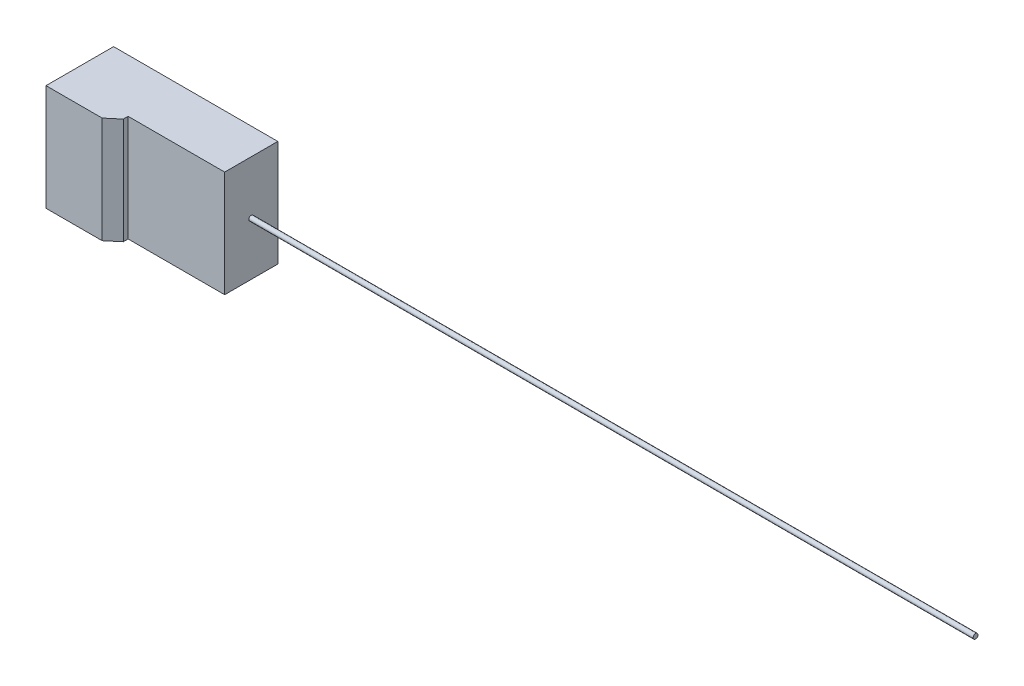
ISO-10303-21;
HEADER;
FILE_DESCRIPTION(('STEP AP214'),'2;1');
FILE_NAME('part.step','',(''),(''),'','','');
FILE_SCHEMA(('AUTOMOTIVE_DESIGN { 1 0 10303 214 1 1 1 1 }'));
ENDSEC;
DATA;
#1=APPLICATION_CONTEXT('core data for automotive mechanical design processes');
#2=APPLICATION_PROTOCOL_DEFINITION('international standard','automotive_design',2000,#1);
#3=PRODUCT_CONTEXT('',#1,'mechanical');
#4=PRODUCT('Part','Part','',(#3));
#5=PRODUCT_RELATED_PRODUCT_CATEGORY('part','',(#4));
#6=PRODUCT_DEFINITION_FORMATION('','',#4);
#7=PRODUCT_DEFINITION_CONTEXT('part definition',#1,'design');
#8=PRODUCT_DEFINITION('design','',#6,#7);
#9=PRODUCT_DEFINITION_SHAPE('','',#8);
#10=(LENGTH_UNIT() NAMED_UNIT(*) SI_UNIT(.MILLI.,.METRE.));
#11=(NAMED_UNIT(*) PLANE_ANGLE_UNIT() SI_UNIT($,.RADIAN.));
#12=(NAMED_UNIT(*) SI_UNIT($,.STERADIAN.) SOLID_ANGLE_UNIT());
#13=UNCERTAINTY_MEASURE_WITH_UNIT(LENGTH_MEASURE(1.E-05),#10,'distance_accuracy_value','');
#14=(GEOMETRIC_REPRESENTATION_CONTEXT(3) GLOBAL_UNCERTAINTY_ASSIGNED_CONTEXT((#13)) GLOBAL_UNIT_ASSIGNED_CONTEXT((#10,
#11,#12)) REPRESENTATION_CONTEXT('',''));
#15=CARTESIAN_POINT('',(0.,0.,0.));
#16=DIRECTION('',(0.,0.,1.));
#17=DIRECTION('',(1.,0.,0.));
#18=AXIS2_PLACEMENT_3D('',#15,#16,#17);
#19=CARTESIAN_POINT('',(17.,11.,11.));
#20=DIRECTION('',(-1.,0.,0.));
#21=DIRECTION('',(0.,0.,1.));
#22=AXIS2_PLACEMENT_3D('',#19,#20,#21);
#23=PLANE('',#22);
#24=CARTESIAN_POINT('',(17.,0.,5.5));
#25=DIRECTION('',(-1.,0.,0.));
#26=DIRECTION('',(0.,0.,1.));
#27=AXIS2_PLACEMENT_3D('',#24,#25,#26);
#28=CIRCLE('',#27,0.500000000000001);
#29=CARTESIAN_POINT('',(17.,0.,6.));
#30=VERTEX_POINT('',#29);
#31=EDGE_CURVE('E11',#30,#30,#28,.F.);
#32=ORIENTED_EDGE('',*,*,#31,.F.);
#33=EDGE_LOOP('',(#32));
#34=FACE_BOUND('',#33,.T.);
#35=DIRECTION('',(0.,1.,0.));
#36=VECTOR('',#35,1.);
#37=CARTESIAN_POINT('',(17.,11.,0.));
#38=LINE('',#37,#36);
#39=CARTESIAN_POINT('',(17.,-11.,0.));
#40=VERTEX_POINT('',#39);
#41=CARTESIAN_POINT('',(17.,11.,0.));
#42=VERTEX_POINT('',#41);
#43=EDGE_CURVE('E149',#40,#42,#38,.T.);
#44=ORIENTED_EDGE('',*,*,#43,.T.);
#45=DIRECTION('',(0.,0.,-1.));
#46=VECTOR('',#45,1.);
#47=CARTESIAN_POINT('',(17.,11.,11.));
#48=LINE('',#47,#46);
#49=CARTESIAN_POINT('',(17.,11.,11.));
#50=VERTEX_POINT('',#49);
#51=EDGE_CURVE('E177',#50,#42,#48,.T.);
#52=ORIENTED_EDGE('',*,*,#51,.F.);
#53=DIRECTION('',(0.,1.,0.));
#54=VECTOR('',#53,1.);
#55=CARTESIAN_POINT('',(17.,11.,11.));
#56=LINE('',#55,#54);
#57=CARTESIAN_POINT('',(17.,-11.,11.));
#58=VERTEX_POINT('',#57);
#59=EDGE_CURVE('E150',#58,#50,#56,.T.);
#60=ORIENTED_EDGE('',*,*,#59,.F.);
#61=DIRECTION('',(0.,0.,-1.));
#62=VECTOR('',#61,1.);
#63=CARTESIAN_POINT('',(17.,-11.,11.));
#64=LINE('',#63,#62);
#65=EDGE_CURVE('E118',#58,#40,#64,.T.);
#66=ORIENTED_EDGE('',*,*,#65,.T.);
#67=EDGE_LOOP('',(#44,#52,#60,#66));
#68=FACE_BOUND('',#67,.T.);
#69=ADVANCED_FACE('F45',(#34,#68),#23,.F.);
#70=CARTESIAN_POINT('',(-17.,11.,11.));
#71=DIRECTION('',(0.,-1.,0.));
#72=DIRECTION('',(0.,0.,-1.));
#73=AXIS2_PLACEMENT_3D('',#70,#71,#72);
#74=PLANE('',#73);
#75=DIRECTION('',(-1.,0.,0.));
#76=VECTOR('',#75,1.);
#77=CARTESIAN_POINT('',(-17.,11.,14.));
#78=LINE('',#77,#76);
#79=CARTESIAN_POINT('',(-5.38350718518842,11.,14.));
#80=VERTEX_POINT('',#79);
#81=CARTESIAN_POINT('',(-17.,11.,14.));
#82=VERTEX_POINT('',#81);
#83=EDGE_CURVE('E128',#80,#82,#78,.T.);
#84=ORIENTED_EDGE('',*,*,#83,.F.);
#85=DIRECTION('',(0.766044443118976,0.,-0.642787609686541));
#86=VECTOR('',#85,1.);
#87=CARTESIAN_POINT('',(-5.38350718518841,11.,14.));
#88=LINE('',#87,#86);
#89=CARTESIAN_POINT('',(-3.,11.,12.));
#90=VERTEX_POINT('',#89);
#91=EDGE_CURVE('E70',#80,#90,#88,.T.);
#92=ORIENTED_EDGE('',*,*,#91,.T.);
#93=DIRECTION('',(0.,0.,-1.));
#94=VECTOR('',#93,1.);
#95=CARTESIAN_POINT('',(-3.,11.,14.));
#96=LINE('',#95,#94);
#97=CARTESIAN_POINT('',(-3.,11.,11.));
#98=VERTEX_POINT('',#97);
#99=EDGE_CURVE('E142',#90,#98,#96,.T.);
#100=ORIENTED_EDGE('',*,*,#99,.T.);
#101=DIRECTION('',(-1.,0.,0.));
#102=VECTOR('',#101,1.);
#103=CARTESIAN_POINT('',(-17.,11.,11.));
#104=LINE('',#103,#102);
#105=EDGE_CURVE('E154',#50,#98,#104,.T.);
#106=ORIENTED_EDGE('',*,*,#105,.F.);
#107=ORIENTED_EDGE('',*,*,#51,.T.);
#108=DIRECTION('',(-1.,0.,0.));
#109=VECTOR('',#108,1.);
#110=CARTESIAN_POINT('',(-17.,11.,0.));
#111=LINE('',#110,#109);
#112=CARTESIAN_POINT('',(-17.,11.,0.));
#113=VERTEX_POINT('',#112);
#114=EDGE_CURVE('E165',#42,#113,#111,.T.);
#115=ORIENTED_EDGE('',*,*,#114,.T.);
#116=DIRECTION('',(0.,0.,-1.));
#117=VECTOR('',#116,1.);
#118=CARTESIAN_POINT('',(-17.,11.,11.));
#119=LINE('',#118,#117);
#120=EDGE_CURVE('E117',#82,#113,#119,.T.);
#121=ORIENTED_EDGE('',*,*,#120,.F.);
#122=EDGE_LOOP('',(#84,#92,#100,#106,#107,#115,#121));
#123=FACE_BOUND('',#122,.T.);
#124=ADVANCED_FACE('F189',(#123),#74,.F.);
#125=CARTESIAN_POINT('',(-17.,11.,11.));
#126=DIRECTION('',(1.,0.,0.));
#127=DIRECTION('',(0.,0.,-1.));
#128=AXIS2_PLACEMENT_3D('',#125,#126,#127);
#129=PLANE('',#128);
#130=DIRECTION('',(0.,-1.,0.));
#131=VECTOR('',#130,1.);
#132=CARTESIAN_POINT('',(-17.,11.,0.));
#133=LINE('',#132,#131);
#134=CARTESIAN_POINT('',(-17.,-11.,0.));
#135=VERTEX_POINT('',#134);
#136=EDGE_CURVE('E113',#113,#135,#133,.T.);
#137=ORIENTED_EDGE('',*,*,#136,.T.);
#138=DIRECTION('',(0.,0.,-1.));
#139=VECTOR('',#138,1.);
#140=CARTESIAN_POINT('',(-17.,-11.,11.));
#141=LINE('',#140,#139);
#142=CARTESIAN_POINT('',(-17.,-11.,14.));
#143=VERTEX_POINT('',#142);
#144=EDGE_CURVE('E106',#143,#135,#141,.T.);
#145=ORIENTED_EDGE('',*,*,#144,.F.);
#146=DIRECTION('',(0.,-1.,0.));
#147=VECTOR('',#146,1.);
#148=CARTESIAN_POINT('',(-17.,11.,14.));
#149=LINE('',#148,#147);
#150=EDGE_CURVE('E111',#82,#143,#149,.T.);
#151=ORIENTED_EDGE('',*,*,#150,.F.);
#152=ORIENTED_EDGE('',*,*,#120,.T.);
#153=EDGE_LOOP('',(#137,#145,#151,#152));
#154=FACE_BOUND('',#153,.T.);
#155=ADVANCED_FACE('F108',(#154),#129,.F.);
#156=CARTESIAN_POINT('',(-17.,-11.,11.));
#157=DIRECTION('',(0.,1.,0.));
#158=DIRECTION('',(0.,0.,1.));
#159=AXIS2_PLACEMENT_3D('',#156,#157,#158);
#160=PLANE('',#159);
#161=DIRECTION('',(0.,0.,-1.));
#162=VECTOR('',#161,1.);
#163=CARTESIAN_POINT('',(-3.,-11.,14.));
#164=LINE('',#163,#162);
#165=CARTESIAN_POINT('',(-3.,-11.,12.));
#166=VERTEX_POINT('',#165);
#167=CARTESIAN_POINT('',(-3.,-11.,11.));
#168=VERTEX_POINT('',#167);
#169=EDGE_CURVE('E146',#166,#168,#164,.T.);
#170=ORIENTED_EDGE('',*,*,#169,.F.);
#171=DIRECTION('',(-0.766044443118976,0.,0.642787609686541));
#172=VECTOR('',#171,1.);
#173=CARTESIAN_POINT('',(-5.38350718518841,-11.,14.));
#174=LINE('',#173,#172);
#175=CARTESIAN_POINT('',(-5.38350718518841,-11.,14.));
#176=VERTEX_POINT('',#175);
#177=EDGE_CURVE('E55',#166,#176,#174,.T.);
#178=ORIENTED_EDGE('',*,*,#177,.T.);
#179=DIRECTION('',(1.,0.,0.));
#180=VECTOR('',#179,1.);
#181=CARTESIAN_POINT('',(-17.,-11.,14.));
#182=LINE('',#181,#180);
#183=EDGE_CURVE('E121',#143,#176,#182,.T.);
#184=ORIENTED_EDGE('',*,*,#183,.F.);
#185=ORIENTED_EDGE('',*,*,#144,.T.);
#186=DIRECTION('',(1.,0.,0.));
#187=VECTOR('',#186,1.);
#188=CARTESIAN_POINT('',(-17.,-11.,0.));
#189=LINE('',#188,#187);
#190=EDGE_CURVE('E155',#135,#40,#189,.T.);
#191=ORIENTED_EDGE('',*,*,#190,.T.);
#192=ORIENTED_EDGE('',*,*,#65,.F.);
#193=DIRECTION('',(1.,0.,0.));
#194=VECTOR('',#193,1.);
#195=CARTESIAN_POINT('',(-17.,-11.,11.));
#196=LINE('',#195,#194);
#197=EDGE_CURVE('E159',#168,#58,#196,.T.);
#198=ORIENTED_EDGE('',*,*,#197,.F.);
#199=EDGE_LOOP('',(#170,#178,#184,#185,#191,#192,#198));
#200=FACE_BOUND('',#199,.T.);
#201=ADVANCED_FACE('F122',(#200),#160,.F.);
#202=CARTESIAN_POINT('',(0.,0.,11.));
#203=DIRECTION('',(0.,0.,1.));
#204=DIRECTION('',(1.,0.,0.));
#205=AXIS2_PLACEMENT_3D('',#202,#203,#204);
#206=PLANE('',#205);
#207=DIRECTION('',(0.,1.,0.));
#208=VECTOR('',#207,1.);
#209=CARTESIAN_POINT('',(-3.,11.,11.));
#210=LINE('',#209,#208);
#211=EDGE_CURVE('E133',#168,#98,#210,.T.);
#212=ORIENTED_EDGE('',*,*,#211,.F.);
#213=ORIENTED_EDGE('',*,*,#197,.T.);
#214=ORIENTED_EDGE('',*,*,#59,.T.);
#215=ORIENTED_EDGE('',*,*,#105,.T.);
#216=EDGE_LOOP('',(#212,#213,#214,#215));
#217=FACE_BOUND('',#216,.T.);
#218=ADVANCED_FACE('F200',(#217),#206,.T.);
#219=CARTESIAN_POINT('',(0.,0.,0.));
#220=DIRECTION('',(0.,0.,1.));
#221=DIRECTION('',(1.,0.,0.));
#222=AXIS2_PLACEMENT_3D('',#219,#220,#221);
#223=PLANE('',#222);
#224=ORIENTED_EDGE('',*,*,#43,.F.);
#225=ORIENTED_EDGE('',*,*,#190,.F.);
#226=ORIENTED_EDGE('',*,*,#136,.F.);
#227=ORIENTED_EDGE('',*,*,#114,.F.);
#228=EDGE_LOOP('',(#224,#225,#226,#227));
#229=FACE_BOUND('',#228,.T.);
#230=ADVANCED_FACE('F192',(#229),#223,.F.);
#231=CARTESIAN_POINT('',(-3.,11.,14.));
#232=DIRECTION('',(-1.,0.,0.));
#233=DIRECTION('',(0.,-1.,0.));
#234=AXIS2_PLACEMENT_3D('',#231,#232,#233);
#235=PLANE('',#234);
#236=ORIENTED_EDGE('',*,*,#99,.F.);
#237=DIRECTION('',(0.,-1.,0.));
#238=VECTOR('',#237,1.);
#239=CARTESIAN_POINT('',(-3.,-11.,12.));
#240=LINE('',#239,#238);
#241=EDGE_CURVE('E62',#90,#166,#240,.T.);
#242=ORIENTED_EDGE('',*,*,#241,.T.);
#243=ORIENTED_EDGE('',*,*,#169,.T.);
#244=ORIENTED_EDGE('',*,*,#211,.T.);
#245=EDGE_LOOP('',(#236,#242,#243,#244));
#246=FACE_BOUND('',#245,.T.);
#247=ADVANCED_FACE('F210',(#246),#235,.F.);
#248=CARTESIAN_POINT('',(0.,0.,14.));
#249=DIRECTION('',(0.,0.,1.));
#250=DIRECTION('',(1.,0.,0.));
#251=AXIS2_PLACEMENT_3D('',#248,#249,#250);
#252=PLANE('',#251);
#253=ORIENTED_EDGE('',*,*,#183,.T.);
#254=DIRECTION('',(0.,1.,0.));
#255=VECTOR('',#254,1.);
#256=CARTESIAN_POINT('',(-5.38350718518842,11.,14.));
#257=LINE('',#256,#255);
#258=EDGE_CURVE('E181',#176,#80,#257,.T.);
#259=ORIENTED_EDGE('',*,*,#258,.T.);
#260=ORIENTED_EDGE('',*,*,#83,.T.);
#261=ORIENTED_EDGE('',*,*,#150,.T.);
#262=EDGE_LOOP('',(#253,#259,#260,#261));
#263=FACE_BOUND('',#262,.T.);
#264=ADVANCED_FACE('F130',(#263),#252,.T.);
#265=CARTESIAN_POINT('',(-5.38350718518841,0.,14.));
#266=DIRECTION('',(0.642787609686541,0.,0.766044443118976));
#267=DIRECTION('',(0.,-1.,0.));
#268=AXIS2_PLACEMENT_3D('',#265,#266,#267);
#269=PLANE('',#268);
#270=ORIENTED_EDGE('',*,*,#177,.F.);
#271=ORIENTED_EDGE('',*,*,#241,.F.);
#272=ORIENTED_EDGE('',*,*,#91,.F.);
#273=ORIENTED_EDGE('',*,*,#258,.F.);
#274=EDGE_LOOP('',(#270,#271,#272,#273));
#275=FACE_BOUND('',#274,.T.);
#276=ADVANCED_FACE('F48',(#275),#269,.T.);
#277=CARTESIAN_POINT('',(167.,0.,5.5));
#278=DIRECTION('',(-1.,0.,0.));
#279=DIRECTION('',(0.,0.,1.));
#280=AXIS2_PLACEMENT_3D('',#277,#278,#279);
#281=CYLINDRICAL_SURFACE('',#280,0.500000000000001);
#282=CARTESIAN_POINT('',(167.,0.,5.5));
#283=DIRECTION('',(1.,0.,0.));
#284=DIRECTION('',(0.,0.,-1.));
#285=AXIS2_PLACEMENT_3D('',#282,#283,#284);
#286=CIRCLE('',#285,0.500000000000001);
#287=CARTESIAN_POINT('',(167.,0.,5.));
#288=VERTEX_POINT('',#287);
#289=EDGE_CURVE('E137',#288,#288,#286,.T.);
#290=ORIENTED_EDGE('',*,*,#289,.F.);
#291=EDGE_LOOP('',(#290));
#292=FACE_BOUND('',#291,.T.);
#293=ORIENTED_EDGE('',*,*,#31,.T.);
#294=EDGE_LOOP('',(#293));
#295=FACE_BOUND('',#294,.T.);
#296=ADVANCED_FACE('F202',(#292,#295),#281,.T.);
#297=CARTESIAN_POINT('',(167.,0.,5.5));
#298=DIRECTION('',(1.,0.,0.));
#299=DIRECTION('',(0.,0.,-1.));
#300=AXIS2_PLACEMENT_3D('',#297,#298,#299);
#301=PLANE('',#300);
#302=ORIENTED_EDGE('',*,*,#289,.T.);
#303=EDGE_LOOP('',(#302));
#304=FACE_BOUND('',#303,.T.);
#305=ADVANCED_FACE('F207',(#304),#301,.T.);
#306=CLOSED_SHELL('',(#69,#124,#155,#201,#218,#230,#247,#264,#276,#296,#305));
#307=MANIFOLD_SOLID_BREP('B2',#306);
#308=ADVANCED_BREP_SHAPE_REPRESENTATION('',(#18,#307),#14);
#309=SHAPE_DEFINITION_REPRESENTATION(#9,#308);
ENDSEC;
END-ISO-10303-21;
